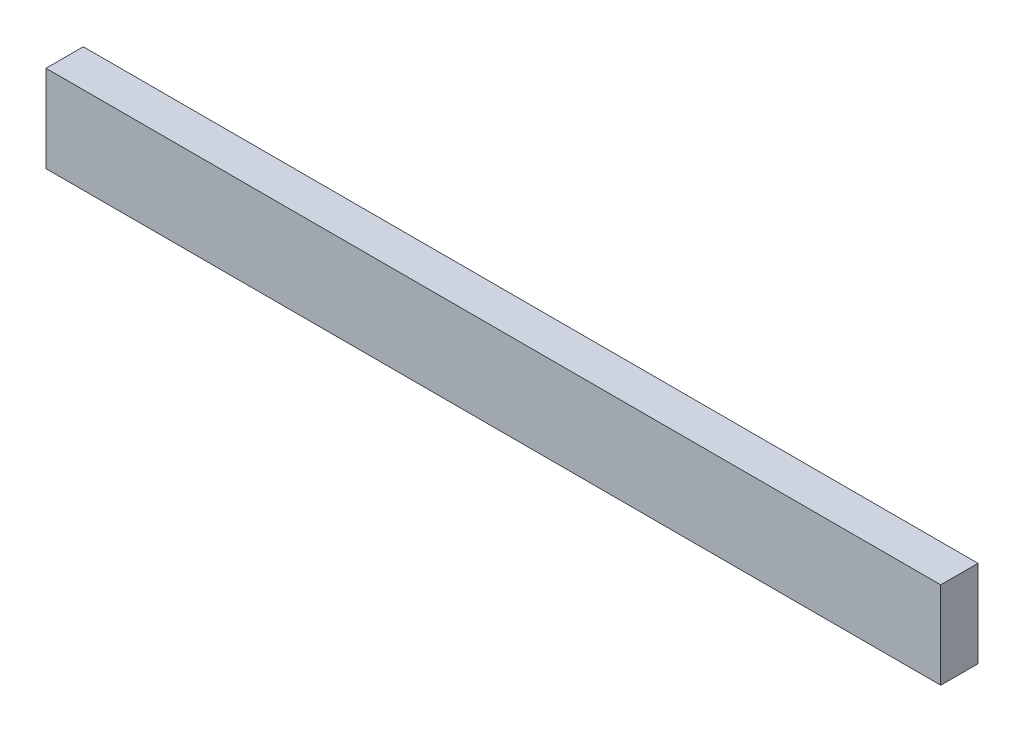
ISO-10303-21;
HEADER;
FILE_DESCRIPTION(('STEP AP214'),'2;1');
FILE_NAME('part.step','',(''),(''),'','','');
FILE_SCHEMA(('AUTOMOTIVE_DESIGN { 1 0 10303 214 1 1 1 1 }'));
ENDSEC;
DATA;
#1=APPLICATION_CONTEXT('core data for automotive mechanical design processes');
#2=APPLICATION_PROTOCOL_DEFINITION('international standard','automotive_design',2000,#1);
#3=PRODUCT_CONTEXT('',#1,'mechanical');
#4=PRODUCT('Part','Part','',(#3));
#5=PRODUCT_RELATED_PRODUCT_CATEGORY('part','',(#4));
#6=PRODUCT_DEFINITION_FORMATION('','',#4);
#7=PRODUCT_DEFINITION_CONTEXT('part definition',#1,'design');
#8=PRODUCT_DEFINITION('design','',#6,#7);
#9=PRODUCT_DEFINITION_SHAPE('','',#8);
#10=(LENGTH_UNIT() NAMED_UNIT(*) SI_UNIT(.MILLI.,.METRE.));
#11=(NAMED_UNIT(*) PLANE_ANGLE_UNIT() SI_UNIT($,.RADIAN.));
#12=(NAMED_UNIT(*) SI_UNIT($,.STERADIAN.) SOLID_ANGLE_UNIT());
#13=UNCERTAINTY_MEASURE_WITH_UNIT(LENGTH_MEASURE(1.E-05),#10,'distance_accuracy_value','');
#14=(GEOMETRIC_REPRESENTATION_CONTEXT(3) GLOBAL_UNCERTAINTY_ASSIGNED_CONTEXT((#13)) GLOBAL_UNIT_ASSIGNED_CONTEXT((#10,
#11,#12)) REPRESENTATION_CONTEXT('',''));
#15=CARTESIAN_POINT('',(0.,0.,0.));
#16=DIRECTION('',(0.,0.,1.));
#17=DIRECTION('',(1.,0.,0.));
#18=AXIS2_PLACEMENT_3D('',#15,#16,#17);
#19=CARTESIAN_POINT('',(914.4,-44.45,-19.05));
#20=DIRECTION('',(0.,0.,1.));
#21=DIRECTION('',(1.,0.,0.));
#22=AXIS2_PLACEMENT_3D('',#19,#20,#21);
#23=PLANE('',#22);
#24=DIRECTION('',(0.,1.,0.));
#25=VECTOR('',#24,1.);
#26=CARTESIAN_POINT('',(0.,-44.45,-19.05));
#27=LINE('',#26,#25);
#28=CARTESIAN_POINT('',(0.,-44.45,-19.05));
#29=VERTEX_POINT('',#28);
#30=CARTESIAN_POINT('',(0.,44.45,-19.05));
#31=VERTEX_POINT('',#30);
#32=EDGE_CURVE('E96',#29,#31,#27,.T.);
#33=ORIENTED_EDGE('',*,*,#32,.T.);
#34=DIRECTION('',(-1.,0.,0.));
#35=VECTOR('',#34,1.);
#36=CARTESIAN_POINT('',(914.4,44.45,-19.05));
#37=LINE('',#36,#35);
#38=CARTESIAN_POINT('',(914.4,44.45,-19.05));
#39=VERTEX_POINT('',#38);
#40=EDGE_CURVE('E11',#39,#31,#37,.T.);
#41=ORIENTED_EDGE('',*,*,#40,.F.);
#42=DIRECTION('',(0.,1.,0.));
#43=VECTOR('',#42,1.);
#44=CARTESIAN_POINT('',(914.4,-44.45,-19.05));
#45=LINE('',#44,#43);
#46=CARTESIAN_POINT('',(914.4,-44.45,-19.05));
#47=VERTEX_POINT('',#46);
#48=EDGE_CURVE('E84',#47,#39,#45,.T.);
#49=ORIENTED_EDGE('',*,*,#48,.F.);
#50=DIRECTION('',(-1.,0.,0.));
#51=VECTOR('',#50,1.);
#52=CARTESIAN_POINT('',(914.4,-44.45,-19.05));
#53=LINE('',#52,#51);
#54=EDGE_CURVE('E92',#47,#29,#53,.T.);
#55=ORIENTED_EDGE('',*,*,#54,.T.);
#56=EDGE_LOOP('',(#33,#41,#49,#55));
#57=FACE_BOUND('',#56,.T.);
#58=ADVANCED_FACE('F33',(#57),#23,.F.);
#59=CARTESIAN_POINT('',(914.4,44.45,19.05));
#60=DIRECTION('',(0.,-1.,0.));
#61=DIRECTION('',(0.,0.,-1.));
#62=AXIS2_PLACEMENT_3D('',#59,#60,#61);
#63=PLANE('',#62);
#64=DIRECTION('',(0.,0.,1.));
#65=VECTOR('',#64,1.);
#66=CARTESIAN_POINT('',(0.,44.45,19.05));
#67=LINE('',#66,#65);
#68=CARTESIAN_POINT('',(0.,44.45,19.05));
#69=VERTEX_POINT('',#68);
#70=EDGE_CURVE('E88',#31,#69,#67,.T.);
#71=ORIENTED_EDGE('',*,*,#70,.T.);
#72=DIRECTION('',(-1.,0.,0.));
#73=VECTOR('',#72,1.);
#74=CARTESIAN_POINT('',(914.4,44.45,19.05));
#75=LINE('',#74,#73);
#76=CARTESIAN_POINT('',(914.4,44.45,19.05));
#77=VERTEX_POINT('',#76);
#78=EDGE_CURVE('E41',#77,#69,#75,.T.);
#79=ORIENTED_EDGE('',*,*,#78,.F.);
#80=DIRECTION('',(0.,0.,1.));
#81=VECTOR('',#80,1.);
#82=CARTESIAN_POINT('',(914.4,44.45,19.05));
#83=LINE('',#82,#81);
#84=EDGE_CURVE('E79',#39,#77,#83,.T.);
#85=ORIENTED_EDGE('',*,*,#84,.F.);
#86=ORIENTED_EDGE('',*,*,#40,.T.);
#87=EDGE_LOOP('',(#71,#79,#85,#86));
#88=FACE_BOUND('',#87,.T.);
#89=ADVANCED_FACE('F87',(#88),#63,.F.);
#90=CARTESIAN_POINT('',(914.4,-44.45,19.05));
#91=DIRECTION('',(0.,0.,-1.));
#92=DIRECTION('',(-1.,0.,0.));
#93=AXIS2_PLACEMENT_3D('',#90,#91,#92);
#94=PLANE('',#93);
#95=DIRECTION('',(0.,-1.,0.));
#96=VECTOR('',#95,1.);
#97=CARTESIAN_POINT('',(0.,-44.45,19.05));
#98=LINE('',#97,#96);
#99=CARTESIAN_POINT('',(0.,-44.45,19.05));
#100=VERTEX_POINT('',#99);
#101=EDGE_CURVE('E66',#69,#100,#98,.T.);
#102=ORIENTED_EDGE('',*,*,#101,.T.);
#103=DIRECTION('',(-1.,0.,0.));
#104=VECTOR('',#103,1.);
#105=CARTESIAN_POINT('',(914.4,-44.45,19.05));
#106=LINE('',#105,#104);
#107=CARTESIAN_POINT('',(914.4,-44.45,19.05));
#108=VERTEX_POINT('',#107);
#109=EDGE_CURVE('E89',#108,#100,#106,.T.);
#110=ORIENTED_EDGE('',*,*,#109,.F.);
#111=DIRECTION('',(0.,-1.,0.));
#112=VECTOR('',#111,1.);
#113=CARTESIAN_POINT('',(914.4,-44.45,19.05));
#114=LINE('',#113,#112);
#115=EDGE_CURVE('E82',#77,#108,#114,.T.);
#116=ORIENTED_EDGE('',*,*,#115,.F.);
#117=ORIENTED_EDGE('',*,*,#78,.T.);
#118=EDGE_LOOP('',(#102,#110,#116,#117));
#119=FACE_BOUND('',#118,.T.);
#120=ADVANCED_FACE('F90',(#119),#94,.F.);
#121=CARTESIAN_POINT('',(914.4,-44.45,19.05));
#122=DIRECTION('',(0.,1.,0.));
#123=DIRECTION('',(0.,0.,1.));
#124=AXIS2_PLACEMENT_3D('',#121,#122,#123);
#125=PLANE('',#124);
#126=DIRECTION('',(0.,0.,-1.));
#127=VECTOR('',#126,1.);
#128=CARTESIAN_POINT('',(0.,-44.45,19.05));
#129=LINE('',#128,#127);
#130=EDGE_CURVE('E72',#100,#29,#129,.T.);
#131=ORIENTED_EDGE('',*,*,#130,.T.);
#132=ORIENTED_EDGE('',*,*,#54,.F.);
#133=DIRECTION('',(0.,0.,-1.));
#134=VECTOR('',#133,1.);
#135=CARTESIAN_POINT('',(914.4,-44.45,19.05));
#136=LINE('',#135,#134);
#137=EDGE_CURVE('E49',#108,#47,#136,.T.);
#138=ORIENTED_EDGE('',*,*,#137,.F.);
#139=ORIENTED_EDGE('',*,*,#109,.T.);
#140=EDGE_LOOP('',(#131,#132,#138,#139));
#141=FACE_BOUND('',#140,.T.);
#142=ADVANCED_FACE('F103',(#141),#125,.F.);
#143=CARTESIAN_POINT('',(914.4,0.,0.));
#144=DIRECTION('',(-1.,0.,0.));
#145=DIRECTION('',(0.,0.,1.));
#146=AXIS2_PLACEMENT_3D('',#143,#144,#145);
#147=PLANE('',#146);
#148=ORIENTED_EDGE('',*,*,#48,.T.);
#149=ORIENTED_EDGE('',*,*,#84,.T.);
#150=ORIENTED_EDGE('',*,*,#115,.T.);
#151=ORIENTED_EDGE('',*,*,#137,.T.);
#152=EDGE_LOOP('',(#148,#149,#150,#151));
#153=FACE_BOUND('',#152,.T.);
#154=ADVANCED_FACE('F80',(#153),#147,.F.);
#155=CARTESIAN_POINT('',(0.,0.,0.));
#156=DIRECTION('',(-1.,0.,0.));
#157=DIRECTION('',(0.,0.,1.));
#158=AXIS2_PLACEMENT_3D('',#155,#156,#157);
#159=PLANE('',#158);
#160=ORIENTED_EDGE('',*,*,#32,.F.);
#161=ORIENTED_EDGE('',*,*,#130,.F.);
#162=ORIENTED_EDGE('',*,*,#101,.F.);
#163=ORIENTED_EDGE('',*,*,#70,.F.);
#164=EDGE_LOOP('',(#160,#161,#162,#163));
#165=FACE_BOUND('',#164,.T.);
#166=ADVANCED_FACE('F106',(#165),#159,.T.);
#167=CLOSED_SHELL('',(#58,#89,#120,#142,#154,#166));
#168=MANIFOLD_SOLID_BREP('B2',#167);
#169=ADVANCED_BREP_SHAPE_REPRESENTATION('',(#18,#168),#14);
#170=SHAPE_DEFINITION_REPRESENTATION(#9,#169);
ENDSEC;
END-ISO-10303-21;
